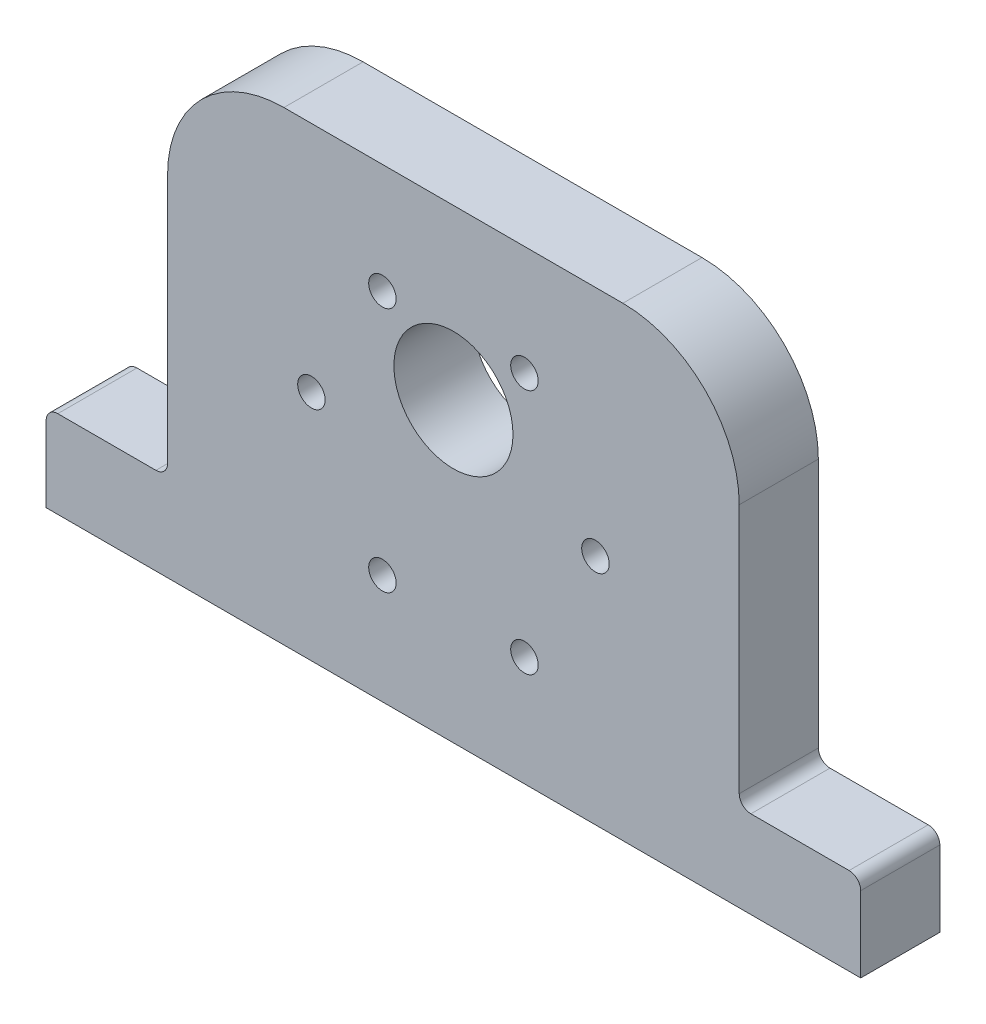
ISO-10303-21;
HEADER;
FILE_DESCRIPTION(('STEP AP214'),'2;1');
FILE_NAME('part.step','',(''),(''),'','','');
FILE_SCHEMA(('AUTOMOTIVE_DESIGN { 1 0 10303 214 1 1 1 1 }'));
ENDSEC;
DATA;
#1=APPLICATION_CONTEXT('core data for automotive mechanical design processes');
#2=APPLICATION_PROTOCOL_DEFINITION('international standard','automotive_design',2000,#1);
#3=PRODUCT_CONTEXT('',#1,'mechanical');
#4=PRODUCT('Part','Part','',(#3));
#5=PRODUCT_RELATED_PRODUCT_CATEGORY('part','',(#4));
#6=PRODUCT_DEFINITION_FORMATION('','',#4);
#7=PRODUCT_DEFINITION_CONTEXT('part definition',#1,'design');
#8=PRODUCT_DEFINITION('design','',#6,#7);
#9=PRODUCT_DEFINITION_SHAPE('','',#8);
#10=(LENGTH_UNIT() NAMED_UNIT(*) SI_UNIT(.MILLI.,.METRE.));
#11=(NAMED_UNIT(*) PLANE_ANGLE_UNIT() SI_UNIT($,.RADIAN.));
#12=(NAMED_UNIT(*) SI_UNIT($,.STERADIAN.) SOLID_ANGLE_UNIT());
#13=UNCERTAINTY_MEASURE_WITH_UNIT(LENGTH_MEASURE(1.E-05),#10,'distance_accuracy_value','');
#14=(GEOMETRIC_REPRESENTATION_CONTEXT(3) GLOBAL_UNCERTAINTY_ASSIGNED_CONTEXT((#13)) GLOBAL_UNIT_ASSIGNED_CONTEXT((#10,
#11,#12)) REPRESENTATION_CONTEXT('',''));
#15=CARTESIAN_POINT('',(0.,0.,0.));
#16=DIRECTION('',(0.,0.,1.));
#17=DIRECTION('',(1.,0.,0.));
#18=AXIS2_PLACEMENT_3D('',#15,#16,#17);
#19=CARTESIAN_POINT('',(0.,0.,8.636));
#20=DIRECTION('',(0.,0.,-1.));
#21=DIRECTION('',(-1.,0.,0.));
#22=AXIS2_PLACEMENT_3D('',#19,#20,#21);
#23=PLANE('',#22);
#24=CARTESIAN_POINT('',(36.7,38.8233937586588,8.636));
#25=DIRECTION('',(0.,0.,1.));
#26=DIRECTION('',(1.,0.,0.));
#27=AXIS2_PLACEMENT_3D('',#24,#25,#26);
#28=CIRCLE('',#27,1.50000000000001);
#29=CARTESIAN_POINT('',(38.2,38.8233937586588,8.636));
#30=VERTEX_POINT('',#29);
#31=EDGE_CURVE('E503',#30,#30,#28,.T.);
#32=ORIENTED_EDGE('',*,*,#31,.F.);
#33=EDGE_LOOP('',(#32));
#34=FACE_BOUND('',#33,.T.);
#35=CARTESIAN_POINT('',(52.2,11.9766062413412,8.636));
#36=DIRECTION('',(0.,0.,1.));
#37=DIRECTION('',(1.,0.,0.));
#38=AXIS2_PLACEMENT_3D('',#35,#36,#37);
#39=CIRCLE('',#38,1.5);
#40=CARTESIAN_POINT('',(53.7,11.9766062413412,8.636));
#41=VERTEX_POINT('',#40);
#42=EDGE_CURVE('E515',#41,#41,#39,.T.);
#43=ORIENTED_EDGE('',*,*,#42,.F.);
#44=EDGE_LOOP('',(#43));
#45=FACE_BOUND('',#44,.T.);
#46=CARTESIAN_POINT('',(28.95,25.4,8.636));
#47=DIRECTION('',(0.,0.,1.));
#48=DIRECTION('',(1.,0.,0.));
#49=AXIS2_PLACEMENT_3D('',#46,#47,#48);
#50=CIRCLE('',#49,1.5);
#51=CARTESIAN_POINT('',(30.45,25.4,8.636));
#52=VERTEX_POINT('',#51);
#53=EDGE_CURVE('E527',#52,#52,#50,.T.);
#54=ORIENTED_EDGE('',*,*,#53,.F.);
#55=EDGE_LOOP('',(#54));
#56=FACE_BOUND('',#55,.T.);
#57=DIRECTION('',(0.,1.,0.));
#58=VECTOR('',#57,1.);
#59=CARTESIAN_POINT('',(88.9,0.,8.636));
#60=LINE('',#59,#58);
#61=CARTESIAN_POINT('',(88.9,0.,8.636));
#62=VERTEX_POINT('',#61);
#63=CARTESIAN_POINT('',(88.9,8.255,8.636));
#64=VERTEX_POINT('',#63);
#65=EDGE_CURVE('E151',#62,#64,#60,.T.);
#66=ORIENTED_EDGE('',*,*,#65,.T.);
#67=CARTESIAN_POINT('',(87.63,8.255,8.636));
#68=DIRECTION('',(0.,0.,-1.));
#69=DIRECTION('',(-1.,0.,0.));
#70=AXIS2_PLACEMENT_3D('',#67,#68,#69);
#71=CIRCLE('',#70,1.27);
#72=CARTESIAN_POINT('',(87.63,9.525,8.636));
#73=VERTEX_POINT('',#72);
#74=EDGE_CURVE('E197',#64,#73,#71,.F.);
#75=ORIENTED_EDGE('',*,*,#74,.T.);
#76=DIRECTION('',(-1.,0.,0.));
#77=VECTOR('',#76,1.);
#78=CARTESIAN_POINT('',(75.6412,9.52500000000001,8.636));
#79=LINE('',#78,#77);
#80=CARTESIAN_POINT('',(76.9112,9.52500000000001,8.636));
#81=VERTEX_POINT('',#80);
#82=EDGE_CURVE('E256',#73,#81,#79,.T.);
#83=ORIENTED_EDGE('',*,*,#82,.T.);
#84=CARTESIAN_POINT('',(76.9112,10.795,8.636));
#85=DIRECTION('',(0.,0.,-1.));
#86=DIRECTION('',(-1.,0.,0.));
#87=AXIS2_PLACEMENT_3D('',#84,#85,#86);
#88=CIRCLE('',#87,1.27);
#89=CARTESIAN_POINT('',(75.6412,10.795,8.636));
#90=VERTEX_POINT('',#89);
#91=EDGE_CURVE('E209',#81,#90,#88,.T.);
#92=ORIENTED_EDGE('',*,*,#91,.T.);
#93=DIRECTION('',(0.,1.,0.));
#94=VECTOR('',#93,1.);
#95=CARTESIAN_POINT('',(75.6412,50.8,8.636));
#96=LINE('',#95,#94);
#97=CARTESIAN_POINT('',(75.6412,38.1,8.636));
#98=VERTEX_POINT('',#97);
#99=EDGE_CURVE('E259',#90,#98,#96,.T.);
#100=ORIENTED_EDGE('',*,*,#99,.T.);
#101=CARTESIAN_POINT('',(62.9412,38.1,8.636));
#102=DIRECTION('',(0.,0.,-1.));
#103=DIRECTION('',(-1.,0.,0.));
#104=AXIS2_PLACEMENT_3D('',#101,#102,#103);
#105=CIRCLE('',#104,12.7);
#106=CARTESIAN_POINT('',(62.9412,50.8,8.636));
#107=VERTEX_POINT('',#106);
#108=EDGE_CURVE('E177',#98,#107,#105,.F.);
#109=ORIENTED_EDGE('',*,*,#108,.T.);
#110=DIRECTION('',(-1.,0.,0.));
#111=VECTOR('',#110,1.);
#112=CARTESIAN_POINT('',(13.25,50.8,8.636));
#113=LINE('',#112,#111);
#114=CARTESIAN_POINT('',(25.95,50.8,8.636));
#115=VERTEX_POINT('',#114);
#116=EDGE_CURVE('E233',#107,#115,#113,.T.);
#117=ORIENTED_EDGE('',*,*,#116,.T.);
#118=CARTESIAN_POINT('',(25.95,38.1,8.636));
#119=DIRECTION('',(0.,0.,-1.));
#120=DIRECTION('',(-1.,0.,0.));
#121=AXIS2_PLACEMENT_3D('',#118,#119,#120);
#122=CIRCLE('',#121,12.7);
#123=CARTESIAN_POINT('',(13.25,38.1,8.636));
#124=VERTEX_POINT('',#123);
#125=EDGE_CURVE('E175',#115,#124,#122,.F.);
#126=ORIENTED_EDGE('',*,*,#125,.T.);
#127=DIRECTION('',(0.,-1.,0.));
#128=VECTOR('',#127,1.);
#129=CARTESIAN_POINT('',(13.25,9.525,8.636));
#130=LINE('',#129,#128);
#131=CARTESIAN_POINT('',(13.25,10.795,8.636));
#132=VERTEX_POINT('',#131);
#133=EDGE_CURVE('E230',#124,#132,#130,.T.);
#134=ORIENTED_EDGE('',*,*,#133,.T.);
#135=CARTESIAN_POINT('',(11.98,10.795,8.636));
#136=DIRECTION('',(0.,0.,-1.));
#137=DIRECTION('',(-1.,0.,0.));
#138=AXIS2_PLACEMENT_3D('',#135,#136,#137);
#139=CIRCLE('',#138,1.27);
#140=CARTESIAN_POINT('',(11.98,9.525,8.636));
#141=VERTEX_POINT('',#140);
#142=EDGE_CURVE('E11',#132,#141,#139,.T.);
#143=ORIENTED_EDGE('',*,*,#142,.T.);
#144=DIRECTION('',(-1.,0.,0.));
#145=VECTOR('',#144,1.);
#146=CARTESIAN_POINT('',(0.,9.525,8.636));
#147=LINE('',#146,#145);
#148=CARTESIAN_POINT('',(1.27,9.525,8.636));
#149=VERTEX_POINT('',#148);
#150=EDGE_CURVE('E161',#141,#149,#147,.T.);
#151=ORIENTED_EDGE('',*,*,#150,.T.);
#152=CARTESIAN_POINT('',(1.27,8.255,8.636));
#153=DIRECTION('',(0.,0.,-1.));
#154=DIRECTION('',(-1.,0.,0.));
#155=AXIS2_PLACEMENT_3D('',#152,#153,#154);
#156=CIRCLE('',#155,1.27);
#157=CARTESIAN_POINT('',(0.,8.255,8.636));
#158=VERTEX_POINT('',#157);
#159=EDGE_CURVE('E48',#149,#158,#156,.F.);
#160=ORIENTED_EDGE('',*,*,#159,.T.);
#161=DIRECTION('',(0.,-1.,0.));
#162=VECTOR('',#161,1.);
#163=CARTESIAN_POINT('',(0.,0.,8.636));
#164=LINE('',#163,#162);
#165=CARTESIAN_POINT('',(0.,0.,8.636));
#166=VERTEX_POINT('',#165);
#167=EDGE_CURVE('E132',#158,#166,#164,.T.);
#168=ORIENTED_EDGE('',*,*,#167,.T.);
#169=DIRECTION('',(1.,0.,0.));
#170=VECTOR('',#169,1.);
#171=CARTESIAN_POINT('',(0.,0.,8.636));
#172=LINE('',#171,#170);
#173=EDGE_CURVE('E136',#166,#62,#172,.T.);
#174=ORIENTED_EDGE('',*,*,#173,.T.);
#175=EDGE_LOOP('',(#66,#75,#83,#92,#100,#109,#117,#126,#134,#143,#151,#160,#168,#174));
#176=FACE_BOUND('',#175,.T.);
#177=CARTESIAN_POINT('',(44.45,32.4,8.636));
#178=DIRECTION('',(0.,0.,1.));
#179=DIRECTION('',(1.,0.,0.));
#180=AXIS2_PLACEMENT_3D('',#177,#178,#179);
#181=CIRCLE('',#180,6.5);
#182=CARTESIAN_POINT('',(50.95,32.4,8.636));
#183=VERTEX_POINT('',#182);
#184=EDGE_CURVE('E239',#183,#183,#181,.T.);
#185=ORIENTED_EDGE('',*,*,#184,.F.);
#186=EDGE_LOOP('',(#185));
#187=FACE_BOUND('',#186,.T.);
#188=CARTESIAN_POINT('',(59.95,25.4,8.636));
#189=DIRECTION('',(0.,0.,1.));
#190=DIRECTION('',(1.,0.,0.));
#191=AXIS2_PLACEMENT_3D('',#188,#189,#190);
#192=CIRCLE('',#191,1.5);
#193=CARTESIAN_POINT('',(61.45,25.4,8.636));
#194=VERTEX_POINT('',#193);
#195=EDGE_CURVE('E521',#194,#194,#192,.T.);
#196=ORIENTED_EDGE('',*,*,#195,.F.);
#197=EDGE_LOOP('',(#196));
#198=FACE_BOUND('',#197,.T.);
#199=CARTESIAN_POINT('',(36.7,11.9766062413412,8.636));
#200=DIRECTION('',(0.,0.,1.));
#201=DIRECTION('',(1.,0.,0.));
#202=AXIS2_PLACEMENT_3D('',#199,#200,#201);
#203=CIRCLE('',#202,1.50000000000001);
#204=CARTESIAN_POINT('',(38.2,11.9766062413412,8.636));
#205=VERTEX_POINT('',#204);
#206=EDGE_CURVE('E509',#205,#205,#203,.T.);
#207=ORIENTED_EDGE('',*,*,#206,.F.);
#208=EDGE_LOOP('',(#207));
#209=FACE_BOUND('',#208,.T.);
#210=CARTESIAN_POINT('',(52.1999999999999,38.8233937586588,8.636));
#211=DIRECTION('',(0.,0.,1.));
#212=DIRECTION('',(1.,0.,0.));
#213=AXIS2_PLACEMENT_3D('',#210,#211,#212);
#214=CIRCLE('',#213,1.50000000000001);
#215=CARTESIAN_POINT('',(53.7,38.8233937586588,8.636));
#216=VERTEX_POINT('',#215);
#217=EDGE_CURVE('E494',#216,#216,#214,.T.);
#218=ORIENTED_EDGE('',*,*,#217,.F.);
#219=EDGE_LOOP('',(#218));
#220=FACE_BOUND('',#219,.T.);
#221=ADVANCED_FACE('F33',(#34,#45,#56,#176,#187,#198,#209,#220),#23,.F.);
#222=CARTESIAN_POINT('',(0.,0.,0.));
#223=DIRECTION('',(0.,0.,-1.));
#224=DIRECTION('',(-1.,0.,0.));
#225=AXIS2_PLACEMENT_3D('',#222,#223,#224);
#226=PLANE('',#225);
#227=CARTESIAN_POINT('',(36.7,38.8233937586588,0.));
#228=DIRECTION('',(0.,0.,1.));
#229=DIRECTION('',(1.,0.,0.));
#230=AXIS2_PLACEMENT_3D('',#227,#228,#229);
#231=CIRCLE('',#230,1.50000000000001);
#232=CARTESIAN_POINT('',(38.2,38.8233937586588,0.));
#233=VERTEX_POINT('',#232);
#234=EDGE_CURVE('E500',#233,#233,#231,.T.);
#235=ORIENTED_EDGE('',*,*,#234,.T.);
#236=EDGE_LOOP('',(#235));
#237=FACE_BOUND('',#236,.T.);
#238=CARTESIAN_POINT('',(52.2,11.9766062413412,0.));
#239=DIRECTION('',(0.,0.,1.));
#240=DIRECTION('',(1.,0.,0.));
#241=AXIS2_PLACEMENT_3D('',#238,#239,#240);
#242=CIRCLE('',#241,1.5);
#243=CARTESIAN_POINT('',(53.7,11.9766062413412,0.));
#244=VERTEX_POINT('',#243);
#245=EDGE_CURVE('E512',#244,#244,#242,.T.);
#246=ORIENTED_EDGE('',*,*,#245,.T.);
#247=EDGE_LOOP('',(#246));
#248=FACE_BOUND('',#247,.T.);
#249=CARTESIAN_POINT('',(28.95,25.4,0.));
#250=DIRECTION('',(0.,0.,1.));
#251=DIRECTION('',(1.,0.,0.));
#252=AXIS2_PLACEMENT_3D('',#249,#250,#251);
#253=CIRCLE('',#252,1.5);
#254=CARTESIAN_POINT('',(30.45,25.4,0.));
#255=VERTEX_POINT('',#254);
#256=EDGE_CURVE('E524',#255,#255,#253,.T.);
#257=ORIENTED_EDGE('',*,*,#256,.T.);
#258=EDGE_LOOP('',(#257));
#259=FACE_BOUND('',#258,.T.);
#260=DIRECTION('',(-1.,0.,0.));
#261=VECTOR('',#260,1.);
#262=CARTESIAN_POINT('',(75.6412,9.52500000000001,0.));
#263=LINE('',#262,#261);
#264=CARTESIAN_POINT('',(87.63,9.525,0.));
#265=VERTEX_POINT('',#264);
#266=CARTESIAN_POINT('',(76.9112,9.52500000000001,0.));
#267=VERTEX_POINT('',#266);
#268=EDGE_CURVE('E244',#265,#267,#263,.T.);
#269=ORIENTED_EDGE('',*,*,#268,.F.);
#270=CARTESIAN_POINT('',(87.63,8.255,0.));
#271=DIRECTION('',(0.,0.,-1.));
#272=DIRECTION('',(-1.,0.,0.));
#273=AXIS2_PLACEMENT_3D('',#270,#271,#272);
#274=CIRCLE('',#273,1.27);
#275=CARTESIAN_POINT('',(88.9,8.255,0.));
#276=VERTEX_POINT('',#275);
#277=EDGE_CURVE('E192',#265,#276,#274,.T.);
#278=ORIENTED_EDGE('',*,*,#277,.T.);
#279=DIRECTION('',(0.,1.,0.));
#280=VECTOR('',#279,1.);
#281=CARTESIAN_POINT('',(88.9,0.,0.));
#282=LINE('',#281,#280);
#283=CARTESIAN_POINT('',(88.9,0.,0.));
#284=VERTEX_POINT('',#283);
#285=EDGE_CURVE('E241',#284,#276,#282,.T.);
#286=ORIENTED_EDGE('',*,*,#285,.F.);
#287=DIRECTION('',(1.,0.,0.));
#288=VECTOR('',#287,1.);
#289=CARTESIAN_POINT('',(0.,0.,0.));
#290=LINE('',#289,#288);
#291=CARTESIAN_POINT('',(0.,0.,0.));
#292=VERTEX_POINT('',#291);
#293=EDGE_CURVE('E238',#292,#284,#290,.T.);
#294=ORIENTED_EDGE('',*,*,#293,.F.);
#295=DIRECTION('',(0.,-1.,0.));
#296=VECTOR('',#295,1.);
#297=CARTESIAN_POINT('',(0.,0.,0.));
#298=LINE('',#297,#296);
#299=CARTESIAN_POINT('',(0.,8.255,0.));
#300=VERTEX_POINT('',#299);
#301=EDGE_CURVE('E155',#300,#292,#298,.T.);
#302=ORIENTED_EDGE('',*,*,#301,.F.);
#303=CARTESIAN_POINT('',(1.27,8.255,0.));
#304=DIRECTION('',(0.,0.,-1.));
#305=DIRECTION('',(-1.,0.,0.));
#306=AXIS2_PLACEMENT_3D('',#303,#304,#305);
#307=CIRCLE('',#306,1.27);
#308=CARTESIAN_POINT('',(1.27,9.525,0.));
#309=VERTEX_POINT('',#308);
#310=EDGE_CURVE('E190',#300,#309,#307,.T.);
#311=ORIENTED_EDGE('',*,*,#310,.T.);
#312=DIRECTION('',(-1.,0.,0.));
#313=VECTOR('',#312,1.);
#314=CARTESIAN_POINT('',(0.,9.525,0.));
#315=LINE('',#314,#313);
#316=CARTESIAN_POINT('',(11.98,9.525,0.));
#317=VERTEX_POINT('',#316);
#318=EDGE_CURVE('E142',#317,#309,#315,.T.);
#319=ORIENTED_EDGE('',*,*,#318,.F.);
#320=CARTESIAN_POINT('',(11.98,10.795,0.));
#321=DIRECTION('',(0.,0.,-1.));
#322=DIRECTION('',(-1.,0.,0.));
#323=AXIS2_PLACEMENT_3D('',#320,#321,#322);
#324=CIRCLE('',#323,1.27);
#325=CARTESIAN_POINT('',(13.25,10.795,0.));
#326=VERTEX_POINT('',#325);
#327=EDGE_CURVE('E41',#317,#326,#324,.F.);
#328=ORIENTED_EDGE('',*,*,#327,.T.);
#329=DIRECTION('',(0.,-1.,0.));
#330=VECTOR('',#329,1.);
#331=CARTESIAN_POINT('',(13.25,9.525,0.));
#332=LINE('',#331,#330);
#333=CARTESIAN_POINT('',(13.25,38.1,0.));
#334=VERTEX_POINT('',#333);
#335=EDGE_CURVE('E217',#334,#326,#332,.T.);
#336=ORIENTED_EDGE('',*,*,#335,.F.);
#337=CARTESIAN_POINT('',(25.95,38.1,0.));
#338=DIRECTION('',(0.,0.,-1.));
#339=DIRECTION('',(-1.,0.,0.));
#340=AXIS2_PLACEMENT_3D('',#337,#338,#339);
#341=CIRCLE('',#340,12.7);
#342=CARTESIAN_POINT('',(25.95,50.8,0.));
#343=VERTEX_POINT('',#342);
#344=EDGE_CURVE('E167',#334,#343,#341,.T.);
#345=ORIENTED_EDGE('',*,*,#344,.T.);
#346=DIRECTION('',(-1.,0.,0.));
#347=VECTOR('',#346,1.);
#348=CARTESIAN_POINT('',(13.25,50.8,0.));
#349=LINE('',#348,#347);
#350=CARTESIAN_POINT('',(62.9412,50.8,0.));
#351=VERTEX_POINT('',#350);
#352=EDGE_CURVE('E226',#351,#343,#349,.T.);
#353=ORIENTED_EDGE('',*,*,#352,.F.);
#354=CARTESIAN_POINT('',(62.9412,38.1,0.));
#355=DIRECTION('',(0.,0.,-1.));
#356=DIRECTION('',(-1.,0.,0.));
#357=AXIS2_PLACEMENT_3D('',#354,#355,#356);
#358=CIRCLE('',#357,12.7);
#359=CARTESIAN_POINT('',(75.6412,38.1,0.));
#360=VERTEX_POINT('',#359);
#361=EDGE_CURVE('E169',#351,#360,#358,.T.);
#362=ORIENTED_EDGE('',*,*,#361,.T.);
#363=DIRECTION('',(0.,1.,0.));
#364=VECTOR('',#363,1.);
#365=CARTESIAN_POINT('',(75.6412,50.8,0.));
#366=LINE('',#365,#364);
#367=CARTESIAN_POINT('',(75.6412,10.795,0.));
#368=VERTEX_POINT('',#367);
#369=EDGE_CURVE('E247',#368,#360,#366,.T.);
#370=ORIENTED_EDGE('',*,*,#369,.F.);
#371=CARTESIAN_POINT('',(76.9112,10.795,0.));
#372=DIRECTION('',(0.,0.,-1.));
#373=DIRECTION('',(-1.,0.,0.));
#374=AXIS2_PLACEMENT_3D('',#371,#372,#373);
#375=CIRCLE('',#374,1.27);
#376=EDGE_CURVE('E207',#368,#267,#375,.F.);
#377=ORIENTED_EDGE('',*,*,#376,.T.);
#378=EDGE_LOOP('',(#269,#278,#286,#294,#302,#311,#319,#328,#336,#345,#353,#362,#370,#377));
#379=FACE_BOUND('',#378,.T.);
#380=CARTESIAN_POINT('',(44.45,32.4,0.));
#381=DIRECTION('',(0.,0.,1.));
#382=DIRECTION('',(1.,0.,0.));
#383=AXIS2_PLACEMENT_3D('',#380,#381,#382);
#384=CIRCLE('',#383,6.5);
#385=CARTESIAN_POINT('',(50.95,32.4,0.));
#386=VERTEX_POINT('',#385);
#387=EDGE_CURVE('E530',#386,#386,#384,.T.);
#388=ORIENTED_EDGE('',*,*,#387,.T.);
#389=EDGE_LOOP('',(#388));
#390=FACE_BOUND('',#389,.T.);
#391=CARTESIAN_POINT('',(59.95,25.4,0.));
#392=DIRECTION('',(0.,0.,1.));
#393=DIRECTION('',(1.,0.,0.));
#394=AXIS2_PLACEMENT_3D('',#391,#392,#393);
#395=CIRCLE('',#394,1.5);
#396=CARTESIAN_POINT('',(61.45,25.4,0.));
#397=VERTEX_POINT('',#396);
#398=EDGE_CURVE('E518',#397,#397,#395,.T.);
#399=ORIENTED_EDGE('',*,*,#398,.T.);
#400=EDGE_LOOP('',(#399));
#401=FACE_BOUND('',#400,.T.);
#402=CARTESIAN_POINT('',(36.7,11.9766062413412,0.));
#403=DIRECTION('',(0.,0.,1.));
#404=DIRECTION('',(1.,0.,0.));
#405=AXIS2_PLACEMENT_3D('',#402,#403,#404);
#406=CIRCLE('',#405,1.50000000000001);
#407=CARTESIAN_POINT('',(38.2,11.9766062413412,0.));
#408=VERTEX_POINT('',#407);
#409=EDGE_CURVE('E506',#408,#408,#406,.T.);
#410=ORIENTED_EDGE('',*,*,#409,.T.);
#411=EDGE_LOOP('',(#410));
#412=FACE_BOUND('',#411,.T.);
#413=CARTESIAN_POINT('',(52.1999999999999,38.8233937586588,0.));
#414=DIRECTION('',(0.,0.,1.));
#415=DIRECTION('',(1.,0.,0.));
#416=AXIS2_PLACEMENT_3D('',#413,#414,#415);
#417=CIRCLE('',#416,1.50000000000001);
#418=CARTESIAN_POINT('',(53.7,38.8233937586588,0.));
#419=VERTEX_POINT('',#418);
#420=EDGE_CURVE('E497',#419,#419,#417,.T.);
#421=ORIENTED_EDGE('',*,*,#420,.T.);
#422=EDGE_LOOP('',(#421));
#423=FACE_BOUND('',#422,.T.);
#424=ADVANCED_FACE('F215',(#237,#248,#259,#379,#390,#401,#412,#423),#226,.T.);
#425=CARTESIAN_POINT('',(0.,0.,8.636));
#426=DIRECTION('',(1.,0.,0.));
#427=DIRECTION('',(0.,0.,-1.));
#428=AXIS2_PLACEMENT_3D('',#425,#426,#427);
#429=PLANE('',#428);
#430=ORIENTED_EDGE('',*,*,#167,.F.);
#431=DIRECTION('',(0.,0.,-1.));
#432=VECTOR('',#431,1.);
#433=CARTESIAN_POINT('',(0.,8.255,8.636));
#434=LINE('',#433,#432);
#435=EDGE_CURVE('E205',#158,#300,#434,.T.);
#436=ORIENTED_EDGE('',*,*,#435,.T.);
#437=ORIENTED_EDGE('',*,*,#301,.T.);
#438=DIRECTION('',(0.,0.,-1.));
#439=VECTOR('',#438,1.);
#440=CARTESIAN_POINT('',(0.,0.,8.636));
#441=LINE('',#440,#439);
#442=EDGE_CURVE('E147',#166,#292,#441,.T.);
#443=ORIENTED_EDGE('',*,*,#442,.F.);
#444=EDGE_LOOP('',(#430,#436,#437,#443));
#445=FACE_BOUND('',#444,.T.);
#446=ADVANCED_FACE('F153',(#445),#429,.F.);
#447=CARTESIAN_POINT('',(0.,0.,8.636));
#448=DIRECTION('',(0.,1.,0.));
#449=DIRECTION('',(-1.,0.,0.));
#450=AXIS2_PLACEMENT_3D('',#447,#448,#449);
#451=PLANE('',#450);
#452=ORIENTED_EDGE('',*,*,#293,.T.);
#453=DIRECTION('',(0.,0.,-1.));
#454=VECTOR('',#453,1.);
#455=CARTESIAN_POINT('',(88.9,0.,8.636));
#456=LINE('',#455,#454);
#457=EDGE_CURVE('E149',#62,#284,#456,.T.);
#458=ORIENTED_EDGE('',*,*,#457,.F.);
#459=ORIENTED_EDGE('',*,*,#173,.F.);
#460=ORIENTED_EDGE('',*,*,#442,.T.);
#461=EDGE_LOOP('',(#452,#458,#459,#460));
#462=FACE_BOUND('',#461,.T.);
#463=ADVANCED_FACE('F146',(#462),#451,.F.);
#464=CARTESIAN_POINT('',(88.9,0.,8.636));
#465=DIRECTION('',(-1.,0.,0.));
#466=DIRECTION('',(0.,0.,1.));
#467=AXIS2_PLACEMENT_3D('',#464,#465,#466);
#468=PLANE('',#467);
#469=ORIENTED_EDGE('',*,*,#285,.T.);
#470=DIRECTION('',(0.,0.,-1.));
#471=VECTOR('',#470,1.);
#472=CARTESIAN_POINT('',(88.9,8.255,8.636));
#473=LINE('',#472,#471);
#474=EDGE_CURVE('E194',#276,#64,#473,.F.);
#475=ORIENTED_EDGE('',*,*,#474,.T.);
#476=ORIENTED_EDGE('',*,*,#65,.F.);
#477=ORIENTED_EDGE('',*,*,#457,.T.);
#478=EDGE_LOOP('',(#469,#475,#476,#477));
#479=FACE_BOUND('',#478,.T.);
#480=ADVANCED_FACE('F253',(#479),#468,.F.);
#481=CARTESIAN_POINT('',(75.6412,9.52500000000001,8.636));
#482=DIRECTION('',(0.,-1.,0.));
#483=DIRECTION('',(1.,0.,0.));
#484=AXIS2_PLACEMENT_3D('',#481,#482,#483);
#485=PLANE('',#484);
#486=ORIENTED_EDGE('',*,*,#268,.T.);
#487=DIRECTION('',(0.,0.,-1.));
#488=VECTOR('',#487,1.);
#489=CARTESIAN_POINT('',(76.9112,9.52500000000001,8.636));
#490=LINE('',#489,#488);
#491=EDGE_CURVE('E188',#267,#81,#490,.F.);
#492=ORIENTED_EDGE('',*,*,#491,.T.);
#493=ORIENTED_EDGE('',*,*,#82,.F.);
#494=DIRECTION('',(0.,0.,-1.));
#495=VECTOR('',#494,1.);
#496=CARTESIAN_POINT('',(87.63,9.525,8.636));
#497=LINE('',#496,#495);
#498=EDGE_CURVE('E185',#73,#265,#497,.T.);
#499=ORIENTED_EDGE('',*,*,#498,.T.);
#500=EDGE_LOOP('',(#486,#492,#493,#499));
#501=FACE_BOUND('',#500,.T.);
#502=ADVANCED_FACE('F287',(#501),#485,.F.);
#503=CARTESIAN_POINT('',(75.6412,50.8,8.636));
#504=DIRECTION('',(-1.,0.,0.));
#505=DIRECTION('',(0.,0.,1.));
#506=AXIS2_PLACEMENT_3D('',#503,#504,#505);
#507=PLANE('',#506);
#508=ORIENTED_EDGE('',*,*,#99,.F.);
#509=DIRECTION('',(0.,0.,-1.));
#510=VECTOR('',#509,1.);
#511=CARTESIAN_POINT('',(75.6412,10.795,0.));
#512=LINE('',#511,#510);
#513=EDGE_CURVE('E182',#90,#368,#512,.T.);
#514=ORIENTED_EDGE('',*,*,#513,.T.);
#515=ORIENTED_EDGE('',*,*,#369,.T.);
#516=DIRECTION('',(0.,0.,-1.));
#517=VECTOR('',#516,1.);
#518=CARTESIAN_POINT('',(75.6412,38.1,8.636));
#519=LINE('',#518,#517);
#520=EDGE_CURVE('E172',#360,#98,#519,.F.);
#521=ORIENTED_EDGE('',*,*,#520,.T.);
#522=EDGE_LOOP('',(#508,#514,#515,#521));
#523=FACE_BOUND('',#522,.T.);
#524=ADVANCED_FACE('F279',(#523),#507,.F.);
#525=CARTESIAN_POINT('',(13.25,50.8,8.636));
#526=DIRECTION('',(0.,-1.,0.));
#527=DIRECTION('',(0.,0.,-1.));
#528=AXIS2_PLACEMENT_3D('',#525,#526,#527);
#529=PLANE('',#528);
#530=ORIENTED_EDGE('',*,*,#116,.F.);
#531=DIRECTION('',(0.,0.,-1.));
#532=VECTOR('',#531,1.);
#533=CARTESIAN_POINT('',(62.9412,50.8,8.636));
#534=LINE('',#533,#532);
#535=EDGE_CURVE('E159',#107,#351,#534,.T.);
#536=ORIENTED_EDGE('',*,*,#535,.T.);
#537=ORIENTED_EDGE('',*,*,#352,.T.);
#538=DIRECTION('',(0.,0.,-1.));
#539=VECTOR('',#538,1.);
#540=CARTESIAN_POINT('',(25.95,50.8,8.636));
#541=LINE('',#540,#539);
#542=EDGE_CURVE('E157',#343,#115,#541,.F.);
#543=ORIENTED_EDGE('',*,*,#542,.T.);
#544=EDGE_LOOP('',(#530,#536,#537,#543));
#545=FACE_BOUND('',#544,.T.);
#546=ADVANCED_FACE('F272',(#545),#529,.F.);
#547=CARTESIAN_POINT('',(13.25,9.525,8.636));
#548=DIRECTION('',(1.,0.,0.));
#549=DIRECTION('',(0.,0.,-1.));
#550=AXIS2_PLACEMENT_3D('',#547,#548,#549);
#551=PLANE('',#550);
#552=ORIENTED_EDGE('',*,*,#335,.T.);
#553=DIRECTION('',(0.,0.,-1.));
#554=VECTOR('',#553,1.);
#555=CARTESIAN_POINT('',(13.25,10.795,8.636));
#556=LINE('',#555,#554);
#557=EDGE_CURVE('E203',#326,#132,#556,.F.);
#558=ORIENTED_EDGE('',*,*,#557,.T.);
#559=ORIENTED_EDGE('',*,*,#133,.F.);
#560=DIRECTION('',(0.,0.,-1.));
#561=VECTOR('',#560,1.);
#562=CARTESIAN_POINT('',(13.25,38.1,8.636));
#563=LINE('',#562,#561);
#564=EDGE_CURVE('E179',#124,#334,#563,.T.);
#565=ORIENTED_EDGE('',*,*,#564,.T.);
#566=EDGE_LOOP('',(#552,#558,#559,#565));
#567=FACE_BOUND('',#566,.T.);
#568=ADVANCED_FACE('F222',(#567),#551,.F.);
#569=CARTESIAN_POINT('',(0.,9.525,8.636));
#570=DIRECTION('',(0.,-1.,0.));
#571=DIRECTION('',(0.,0.,-1.));
#572=AXIS2_PLACEMENT_3D('',#569,#570,#571);
#573=PLANE('',#572);
#574=ORIENTED_EDGE('',*,*,#150,.F.);
#575=DIRECTION('',(0.,0.,-1.));
#576=VECTOR('',#575,1.);
#577=CARTESIAN_POINT('',(11.98,9.525,0.));
#578=LINE('',#577,#576);
#579=EDGE_CURVE('E200',#141,#317,#578,.T.);
#580=ORIENTED_EDGE('',*,*,#579,.T.);
#581=ORIENTED_EDGE('',*,*,#318,.T.);
#582=DIRECTION('',(0.,0.,-1.));
#583=VECTOR('',#582,1.);
#584=CARTESIAN_POINT('',(1.27,9.525,8.636));
#585=LINE('',#584,#583);
#586=EDGE_CURVE('E56',#309,#149,#585,.F.);
#587=ORIENTED_EDGE('',*,*,#586,.T.);
#588=EDGE_LOOP('',(#574,#580,#581,#587));
#589=FACE_BOUND('',#588,.T.);
#590=ADVANCED_FACE('F231',(#589),#573,.F.);
#591=CARTESIAN_POINT('',(44.45,32.4,8.636));
#592=DIRECTION('',(0.,0.,-1.));
#593=DIRECTION('',(-1.,0.,0.));
#594=AXIS2_PLACEMENT_3D('',#591,#592,#593);
#595=CYLINDRICAL_SURFACE('',#594,6.5);
#596=ORIENTED_EDGE('',*,*,#184,.T.);
#597=EDGE_LOOP('',(#596));
#598=FACE_BOUND('',#597,.T.);
#599=ORIENTED_EDGE('',*,*,#387,.F.);
#600=EDGE_LOOP('',(#599));
#601=FACE_BOUND('',#600,.T.);
#602=ADVANCED_FACE('F309',(#598,#601),#595,.F.);
#603=CARTESIAN_POINT('',(28.95,25.4,8.636));
#604=DIRECTION('',(0.,0.,-1.));
#605=DIRECTION('',(-1.,0.,0.));
#606=AXIS2_PLACEMENT_3D('',#603,#604,#605);
#607=CYLINDRICAL_SURFACE('',#606,1.5);
#608=ORIENTED_EDGE('',*,*,#53,.T.);
#609=EDGE_LOOP('',(#608));
#610=FACE_BOUND('',#609,.T.);
#611=ORIENTED_EDGE('',*,*,#256,.F.);
#612=EDGE_LOOP('',(#611));
#613=FACE_BOUND('',#612,.T.);
#614=ADVANCED_FACE('F420',(#610,#613),#607,.F.);
#615=CARTESIAN_POINT('',(59.95,25.4,8.636));
#616=DIRECTION('',(0.,0.,-1.));
#617=DIRECTION('',(-1.,0.,0.));
#618=AXIS2_PLACEMENT_3D('',#615,#616,#617);
#619=CYLINDRICAL_SURFACE('',#618,1.5);
#620=ORIENTED_EDGE('',*,*,#195,.T.);
#621=EDGE_LOOP('',(#620));
#622=FACE_BOUND('',#621,.T.);
#623=ORIENTED_EDGE('',*,*,#398,.F.);
#624=EDGE_LOOP('',(#623));
#625=FACE_BOUND('',#624,.T.);
#626=ADVANCED_FACE('F429',(#622,#625),#619,.F.);
#627=CARTESIAN_POINT('',(52.2,11.9766062413412,8.636));
#628=DIRECTION('',(0.,0.,-1.));
#629=DIRECTION('',(-1.,0.,0.));
#630=AXIS2_PLACEMENT_3D('',#627,#628,#629);
#631=CYLINDRICAL_SURFACE('',#630,1.5);
#632=ORIENTED_EDGE('',*,*,#42,.T.);
#633=EDGE_LOOP('',(#632));
#634=FACE_BOUND('',#633,.T.);
#635=ORIENTED_EDGE('',*,*,#245,.F.);
#636=EDGE_LOOP('',(#635));
#637=FACE_BOUND('',#636,.T.);
#638=ADVANCED_FACE('F438',(#634,#637),#631,.F.);
#639=CARTESIAN_POINT('',(36.7,11.9766062413412,8.636));
#640=DIRECTION('',(0.,0.,-1.));
#641=DIRECTION('',(-1.,0.,0.));
#642=AXIS2_PLACEMENT_3D('',#639,#640,#641);
#643=CYLINDRICAL_SURFACE('',#642,1.50000000000001);
#644=ORIENTED_EDGE('',*,*,#206,.T.);
#645=EDGE_LOOP('',(#644));
#646=FACE_BOUND('',#645,.T.);
#647=ORIENTED_EDGE('',*,*,#409,.F.);
#648=EDGE_LOOP('',(#647));
#649=FACE_BOUND('',#648,.T.);
#650=ADVANCED_FACE('F448',(#646,#649),#643,.F.);
#651=CARTESIAN_POINT('',(36.7,38.8233937586588,8.636));
#652=DIRECTION('',(0.,0.,-1.));
#653=DIRECTION('',(-1.,0.,0.));
#654=AXIS2_PLACEMENT_3D('',#651,#652,#653);
#655=CYLINDRICAL_SURFACE('',#654,1.50000000000001);
#656=ORIENTED_EDGE('',*,*,#31,.T.);
#657=EDGE_LOOP('',(#656));
#658=FACE_BOUND('',#657,.T.);
#659=ORIENTED_EDGE('',*,*,#234,.F.);
#660=EDGE_LOOP('',(#659));
#661=FACE_BOUND('',#660,.T.);
#662=ADVANCED_FACE('F458',(#658,#661),#655,.F.);
#663=CARTESIAN_POINT('',(52.1999999999999,38.8233937586588,8.636));
#664=DIRECTION('',(0.,0.,-1.));
#665=DIRECTION('',(-1.,0.,0.));
#666=AXIS2_PLACEMENT_3D('',#663,#664,#665);
#667=CYLINDRICAL_SURFACE('',#666,1.50000000000001);
#668=ORIENTED_EDGE('',*,*,#217,.T.);
#669=EDGE_LOOP('',(#668));
#670=FACE_BOUND('',#669,.T.);
#671=ORIENTED_EDGE('',*,*,#420,.F.);
#672=EDGE_LOOP('',(#671));
#673=FACE_BOUND('',#672,.T.);
#674=ADVANCED_FACE('F330',(#670,#673),#667,.F.);
#675=CARTESIAN_POINT('',(62.9412,38.1,8.636));
#676=DIRECTION('',(0.,0.,-1.));
#677=DIRECTION('',(-1.,0.,0.));
#678=AXIS2_PLACEMENT_3D('',#675,#676,#677);
#679=CYLINDRICAL_SURFACE('',#678,12.7);
#680=ORIENTED_EDGE('',*,*,#108,.F.);
#681=ORIENTED_EDGE('',*,*,#520,.F.);
#682=ORIENTED_EDGE('',*,*,#361,.F.);
#683=ORIENTED_EDGE('',*,*,#535,.F.);
#684=EDGE_LOOP('',(#680,#681,#682,#683));
#685=FACE_BOUND('',#684,.T.);
#686=ADVANCED_FACE('F274',(#685),#679,.T.);
#687=CARTESIAN_POINT('',(25.95,38.1,8.636));
#688=DIRECTION('',(0.,0.,-1.));
#689=DIRECTION('',(-1.,0.,0.));
#690=AXIS2_PLACEMENT_3D('',#687,#688,#689);
#691=CYLINDRICAL_SURFACE('',#690,12.7);
#692=ORIENTED_EDGE('',*,*,#125,.F.);
#693=ORIENTED_EDGE('',*,*,#542,.F.);
#694=ORIENTED_EDGE('',*,*,#344,.F.);
#695=ORIENTED_EDGE('',*,*,#564,.F.);
#696=EDGE_LOOP('',(#692,#693,#694,#695));
#697=FACE_BOUND('',#696,.T.);
#698=ADVANCED_FACE('F270',(#697),#691,.T.);
#699=CARTESIAN_POINT('',(76.9112,10.795,8.636));
#700=DIRECTION('',(0.,0.,1.));
#701=DIRECTION('',(1.,0.,0.));
#702=AXIS2_PLACEMENT_3D('',#699,#700,#701);
#703=CYLINDRICAL_SURFACE('',#702,1.27);
#704=ORIENTED_EDGE('',*,*,#91,.F.);
#705=ORIENTED_EDGE('',*,*,#491,.F.);
#706=ORIENTED_EDGE('',*,*,#376,.F.);
#707=ORIENTED_EDGE('',*,*,#513,.F.);
#708=EDGE_LOOP('',(#704,#705,#706,#707));
#709=FACE_BOUND('',#708,.T.);
#710=ADVANCED_FACE('F283',(#709),#703,.F.);
#711=CARTESIAN_POINT('',(87.63,8.255,8.636));
#712=DIRECTION('',(0.,0.,-1.));
#713=DIRECTION('',(-1.,0.,0.));
#714=AXIS2_PLACEMENT_3D('',#711,#712,#713);
#715=CYLINDRICAL_SURFACE('',#714,1.27);
#716=ORIENTED_EDGE('',*,*,#74,.F.);
#717=ORIENTED_EDGE('',*,*,#474,.F.);
#718=ORIENTED_EDGE('',*,*,#277,.F.);
#719=ORIENTED_EDGE('',*,*,#498,.F.);
#720=EDGE_LOOP('',(#716,#717,#718,#719));
#721=FACE_BOUND('',#720,.T.);
#722=ADVANCED_FACE('F290',(#721),#715,.T.);
#723=CARTESIAN_POINT('',(11.98,10.795,8.636));
#724=DIRECTION('',(0.,0.,1.));
#725=DIRECTION('',(1.,0.,0.));
#726=AXIS2_PLACEMENT_3D('',#723,#724,#725);
#727=CYLINDRICAL_SURFACE('',#726,1.27);
#728=ORIENTED_EDGE('',*,*,#142,.F.);
#729=ORIENTED_EDGE('',*,*,#557,.F.);
#730=ORIENTED_EDGE('',*,*,#327,.F.);
#731=ORIENTED_EDGE('',*,*,#579,.F.);
#732=EDGE_LOOP('',(#728,#729,#730,#731));
#733=FACE_BOUND('',#732,.T.);
#734=ADVANCED_FACE('F229',(#733),#727,.F.);
#735=CARTESIAN_POINT('',(1.27,8.255,8.636));
#736=DIRECTION('',(0.,0.,-1.));
#737=DIRECTION('',(-1.,0.,0.));
#738=AXIS2_PLACEMENT_3D('',#735,#736,#737);
#739=CYLINDRICAL_SURFACE('',#738,1.27);
#740=ORIENTED_EDGE('',*,*,#159,.F.);
#741=ORIENTED_EDGE('',*,*,#586,.F.);
#742=ORIENTED_EDGE('',*,*,#310,.F.);
#743=ORIENTED_EDGE('',*,*,#435,.F.);
#744=EDGE_LOOP('',(#740,#741,#742,#743));
#745=FACE_BOUND('',#744,.T.);
#746=ADVANCED_FACE('F35',(#745),#739,.T.);
#747=CLOSED_SHELL('',(#221,#424,#446,#463,#480,#502,#524,#546,#568,#590,#602,#614,#626,#638,
#650,#662,#674,#686,#698,#710,#722,#734,#746));
#748=MANIFOLD_SOLID_BREP('B2',#747);
#749=ADVANCED_BREP_SHAPE_REPRESENTATION('',(#18,#748),#14);
#750=SHAPE_DEFINITION_REPRESENTATION(#9,#749);
ENDSEC;
END-ISO-10303-21;
